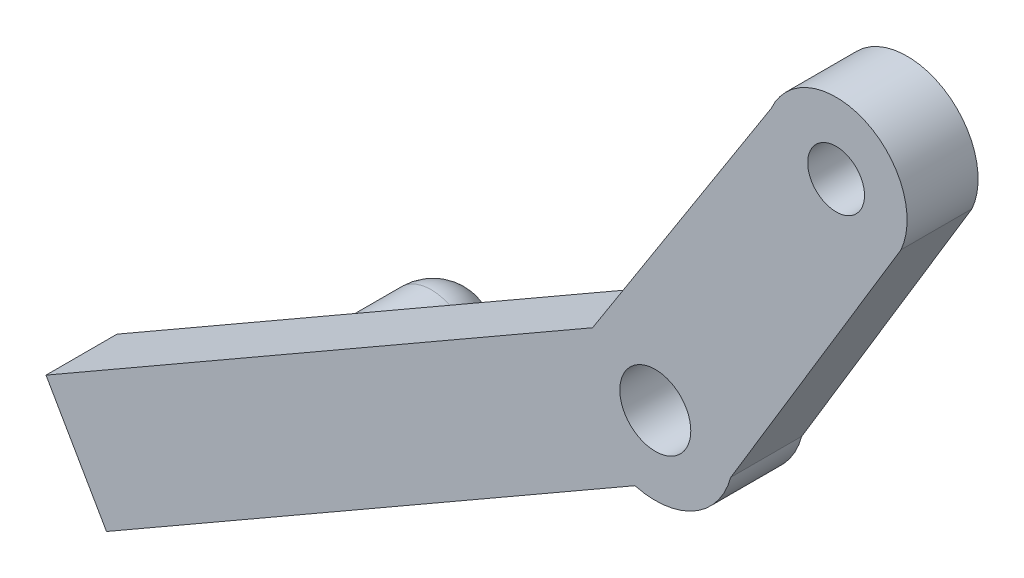
ISO-10303-21;
HEADER;
FILE_DESCRIPTION(('STEP AP214'),'2;1');
FILE_NAME('part.step','',(''),(''),'','','');
FILE_SCHEMA(('AUTOMOTIVE_DESIGN { 1 0 10303 214 1 1 1 1 }'));
ENDSEC;
DATA;
#1=APPLICATION_CONTEXT('core data for automotive mechanical design processes');
#2=APPLICATION_PROTOCOL_DEFINITION('international standard','automotive_design',2000,#1);
#3=PRODUCT_CONTEXT('',#1,'mechanical');
#4=PRODUCT('Part','Part','',(#3));
#5=PRODUCT_RELATED_PRODUCT_CATEGORY('part','',(#4));
#6=PRODUCT_DEFINITION_FORMATION('','',#4);
#7=PRODUCT_DEFINITION_CONTEXT('part definition',#1,'design');
#8=PRODUCT_DEFINITION('design','',#6,#7);
#9=PRODUCT_DEFINITION_SHAPE('','',#8);
#10=(LENGTH_UNIT() NAMED_UNIT(*) SI_UNIT(.MILLI.,.METRE.));
#11=(NAMED_UNIT(*) PLANE_ANGLE_UNIT() SI_UNIT($,.RADIAN.));
#12=(NAMED_UNIT(*) SI_UNIT($,.STERADIAN.) SOLID_ANGLE_UNIT());
#13=UNCERTAINTY_MEASURE_WITH_UNIT(LENGTH_MEASURE(1.E-05),#10,'distance_accuracy_value','');
#14=(GEOMETRIC_REPRESENTATION_CONTEXT(3) GLOBAL_UNCERTAINTY_ASSIGNED_CONTEXT((#13)) GLOBAL_UNIT_ASSIGNED_CONTEXT((#10,
#11,#12)) REPRESENTATION_CONTEXT('',''));
#15=CARTESIAN_POINT('',(0.,0.,0.));
#16=DIRECTION('',(0.,0.,1.));
#17=DIRECTION('',(1.,0.,0.));
#18=AXIS2_PLACEMENT_3D('',#15,#16,#17);
#19=CARTESIAN_POINT('',(-25.2931810081454,-19.8826359089884,-10.));
#20=DIRECTION('',(0.,0.,1.));
#21=DIRECTION('',(1.,0.,0.));
#22=AXIS2_PLACEMENT_3D('',#19,#20,#21);
#23=CYLINDRICAL_SURFACE('',#22,3.00000000000002);
#24=CARTESIAN_POINT('',(-25.2931810081454,-19.8826359089884,0.));
#25=DIRECTION('',(0.,0.,1.));
#26=DIRECTION('',(1.,0.,0.));
#27=AXIS2_PLACEMENT_3D('',#24,#25,#26);
#28=CIRCLE('',#27,3.00000000000002);
#29=CARTESIAN_POINT('',(-22.2931810081454,-19.8826359089884,0.));
#30=VERTEX_POINT('',#29);
#31=EDGE_CURVE('E11',#30,#30,#28,.F.);
#32=ORIENTED_EDGE('',*,*,#31,.T.);
#33=EDGE_LOOP('',(#32));
#34=FACE_BOUND('',#33,.T.);
#35=CARTESIAN_POINT('',(-25.2931810081454,-19.8826359089884,-7.));
#36=DIRECTION('',(0.,0.,-1.));
#37=DIRECTION('',(-1.,0.,0.));
#38=AXIS2_PLACEMENT_3D('',#35,#36,#37);
#39=CIRCLE('',#38,3.00000000000003);
#40=CARTESIAN_POINT('',(-28.2931810081454,-19.8826359089884,-7.));
#41=VERTEX_POINT('',#40);
#42=EDGE_CURVE('E183',#41,#41,#39,.T.);
#43=ORIENTED_EDGE('',*,*,#42,.F.);
#44=EDGE_LOOP('',(#43));
#45=FACE_BOUND('',#44,.T.);
#46=ADVANCED_FACE('F34',(#34,#45),#23,.T.);
#47=CARTESIAN_POINT('',(-0.682703439514869,0.436635830889686,5.));
#48=DIRECTION('',(-0.842436284988127,0.538795977838925,0.));
#49=DIRECTION('',(-0.538795977838925,-0.842436284988127,0.));
#50=AXIS2_PLACEMENT_3D('',#47,#48,#49);
#51=PLANE('',#50);
#52=DIRECTION('',(0.538795977838925,0.842436284988127,0.));
#53=VECTOR('',#52,1.);
#54=CARTESIAN_POINT('',(-0.682703439514869,0.436635830889686,0.));
#55=LINE('',#54,#53);
#56=CARTESIAN_POINT('',(-1.93424021867878,-1.52020875988425,0.));
#57=VERTEX_POINT('',#56);
#58=CARTESIAN_POINT('',(10.6400793801503,18.1404114466345,0.));
#59=VERTEX_POINT('',#58);
#60=EDGE_CURVE('E129',#57,#59,#55,.T.);
#61=ORIENTED_EDGE('',*,*,#60,.F.);
#62=DIRECTION('',(0.,0.,-1.));
#63=VECTOR('',#62,1.);
#64=CARTESIAN_POINT('',(-1.93424021867878,-1.52020875988425,5.));
#65=LINE('',#64,#63);
#66=CARTESIAN_POINT('',(-1.93424021867878,-1.52020875988425,5.));
#67=VERTEX_POINT('',#66);
#68=EDGE_CURVE('E43',#67,#57,#65,.T.);
#69=ORIENTED_EDGE('',*,*,#68,.F.);
#70=DIRECTION('',(0.538795977838925,0.842436284988127,0.));
#71=VECTOR('',#70,1.);
#72=CARTESIAN_POINT('',(-0.682703439514869,0.436635830889686,5.));
#73=LINE('',#72,#71);
#74=CARTESIAN_POINT('',(10.6400793801503,18.1404114466345,5.));
#75=VERTEX_POINT('',#74);
#76=EDGE_CURVE('E150',#67,#75,#73,.T.);
#77=ORIENTED_EDGE('',*,*,#76,.T.);
#78=DIRECTION('',(0.,0.,-1.));
#79=VECTOR('',#78,1.);
#80=CARTESIAN_POINT('',(10.6400793801503,18.1404114466345,5.));
#81=LINE('',#80,#79);
#82=EDGE_CURVE('E84',#75,#59,#81,.T.);
#83=ORIENTED_EDGE('',*,*,#82,.T.);
#84=EDGE_LOOP('',(#61,#69,#77,#83));
#85=FACE_BOUND('',#84,.T.);
#86=ADVANCED_FACE('F36',(#85),#51,.T.);
#87=CARTESIAN_POINT('',(0.17625658415401,-0.30648591573246,5.));
#88=DIRECTION('',(-0.498528903536302,0.866873077410351,0.));
#89=DIRECTION('',(-0.866873077410351,-0.498528903536302,0.));
#90=AXIS2_PLACEMENT_3D('',#87,#88,#89);
#91=PLANE('',#90);
#92=DIRECTION('',(0.866873077410351,0.498528903536302,0.));
#93=VECTOR('',#92,1.);
#94=CARTESIAN_POINT('',(0.17625658415401,-0.30648591573246,0.));
#95=LINE('',#94,#93);
#96=CARTESIAN_POINT('',(-40.4263847840177,-23.6566057999731,0.));
#97=VERTEX_POINT('',#96);
#98=EDGE_CURVE('E132',#97,#57,#95,.T.);
#99=ORIENTED_EDGE('',*,*,#98,.F.);
#100=DIRECTION('',(0.,0.,-1.));
#101=VECTOR('',#100,1.);
#102=CARTESIAN_POINT('',(-40.4263847840177,-23.6566057999731,5.));
#103=LINE('',#102,#101);
#104=CARTESIAN_POINT('',(-40.4263847840177,-23.6566057999731,5.));
#105=VERTEX_POINT('',#104);
#106=EDGE_CURVE('E157',#105,#97,#103,.T.);
#107=ORIENTED_EDGE('',*,*,#106,.F.);
#108=DIRECTION('',(0.866873077410351,0.498528903536302,0.));
#109=VECTOR('',#108,1.);
#110=CARTESIAN_POINT('',(0.17625658415401,-0.30648591573246,5.));
#111=LINE('',#110,#109);
#112=EDGE_CURVE('E163',#105,#67,#111,.T.);
#113=ORIENTED_EDGE('',*,*,#112,.T.);
#114=ORIENTED_EDGE('',*,*,#68,.T.);
#115=EDGE_LOOP('',(#99,#107,#113,#114));
#116=FACE_BOUND('',#115,.T.);
#117=ADVANCED_FACE('F161',(#116),#91,.T.);
#118=CARTESIAN_POINT('',(-40.6026413681717,-23.3501198842406,5.));
#119=DIRECTION('',(0.866873077410351,0.498528903536302,0.));
#120=DIRECTION('',(-0.498528903536302,0.866873077410351,0.));
#121=AXIS2_PLACEMENT_3D('',#118,#119,#120);
#122=PLANE('',#121);
#123=DIRECTION('',(0.498528903536302,-0.866873077410351,0.));
#124=VECTOR('',#123,1.);
#125=CARTESIAN_POINT('',(-40.6026413681717,-23.3501198842406,0.));
#126=LINE('',#125,#124);
#127=CARTESIAN_POINT('',(-36.1661695545836,-31.0645331240926,0.));
#128=VERTEX_POINT('',#127);
#129=EDGE_CURVE('E136',#97,#128,#126,.T.);
#130=ORIENTED_EDGE('',*,*,#129,.T.);
#131=DIRECTION('',(0.,0.,-1.));
#132=VECTOR('',#131,1.);
#133=CARTESIAN_POINT('',(-36.1661695545836,-31.0645331240926,5.));
#134=LINE('',#133,#132);
#135=CARTESIAN_POINT('',(-36.1661695545836,-31.0645331240926,5.));
#136=VERTEX_POINT('',#135);
#137=EDGE_CURVE('E154',#136,#128,#134,.T.);
#138=ORIENTED_EDGE('',*,*,#137,.F.);
#139=DIRECTION('',(0.498528903536302,-0.866873077410351,0.));
#140=VECTOR('',#139,1.);
#141=CARTESIAN_POINT('',(-40.6026413681717,-23.3501198842406,5.));
#142=LINE('',#141,#140);
#143=EDGE_CURVE('E176',#105,#136,#142,.T.);
#144=ORIENTED_EDGE('',*,*,#143,.F.);
#145=ORIENTED_EDGE('',*,*,#106,.T.);
#146=EDGE_LOOP('',(#130,#138,#144,#145));
#147=FACE_BOUND('',#146,.T.);
#148=ADVANCED_FACE('F172',(#147),#122,.F.);
#149=CARTESIAN_POINT('',(4.43647181358803,-7.71441323985198,5.));
#150=DIRECTION('',(-0.498528903536302,0.866873077410351,0.));
#151=DIRECTION('',(-0.866873077410351,-0.498528903536302,0.));
#152=AXIS2_PLACEMENT_3D('',#149,#150,#151);
#153=PLANE('',#152);
#154=DIRECTION('',(0.866873077410351,0.498528903536302,0.));
#155=VECTOR('',#154,1.);
#156=CARTESIAN_POINT('',(4.43647181358803,-7.71441323985198,0.));
#157=LINE('',#156,#155);
#158=CARTESIAN_POINT('',(1.04782478556533,-9.66318582418271,0.));
#159=VERTEX_POINT('',#158);
#160=EDGE_CURVE('E138',#128,#159,#157,.T.);
#161=ORIENTED_EDGE('',*,*,#160,.T.);
#162=DIRECTION('',(0.,0.,-1.));
#163=VECTOR('',#162,1.);
#164=CARTESIAN_POINT('',(1.04782478556533,-9.66318582418271,5.));
#165=LINE('',#164,#163);
#166=CARTESIAN_POINT('',(1.04782478556533,-9.66318582418271,5.));
#167=VERTEX_POINT('',#166);
#168=EDGE_CURVE('E115',#167,#159,#165,.T.);
#169=ORIENTED_EDGE('',*,*,#168,.F.);
#170=DIRECTION('',(0.866873077410351,0.498528903536302,0.));
#171=VECTOR('',#170,1.);
#172=CARTESIAN_POINT('',(4.43647181358803,-7.71441323985198,5.));
#173=LINE('',#172,#171);
#174=EDGE_CURVE('E106',#136,#167,#173,.T.);
#175=ORIENTED_EDGE('',*,*,#174,.F.);
#176=ORIENTED_EDGE('',*,*,#137,.T.);
#177=EDGE_LOOP('',(#161,#169,#175,#176));
#178=FACE_BOUND('',#177,.T.);
#179=ADVANCED_FACE('F175',(#178),#153,.F.);
#180=CARTESIAN_POINT('',(2.48034743292827,-4.35301832543163,5.));
#181=DIRECTION('',(0.,0.,-1.));
#182=DIRECTION('',(-1.,0.,0.));
#183=AXIS2_PLACEMENT_3D('',#180,#181,#182);
#184=CYLINDRICAL_SURFACE('',#183,5.5);
#185=CARTESIAN_POINT('',(2.48034743292827,-4.35301832543163,0.));
#186=DIRECTION('',(0.,0.,1.));
#187=DIRECTION('',(1.,0.,0.));
#188=AXIS2_PLACEMENT_3D('',#185,#186,#187);
#189=CIRCLE('',#188,5.5);
#190=CARTESIAN_POINT('',(7.79051493167935,-5.78554097279456,0.));
#191=VERTEX_POINT('',#190);
#192=EDGE_CURVE('E114',#159,#191,#189,.T.);
#193=ORIENTED_EDGE('',*,*,#192,.T.);
#194=DIRECTION('',(0.,0.,-1.));
#195=VECTOR('',#194,1.);
#196=CARTESIAN_POINT('',(7.79051493167935,-5.78554097279456,5.));
#197=LINE('',#196,#195);
#198=CARTESIAN_POINT('',(7.79051493167935,-5.78554097279456,5.));
#199=VERTEX_POINT('',#198);
#200=EDGE_CURVE('E111',#199,#191,#197,.T.);
#201=ORIENTED_EDGE('',*,*,#200,.F.);
#202=CARTESIAN_POINT('',(2.48034743292827,-4.35301832543163,5.));
#203=DIRECTION('',(0.,0.,1.));
#204=DIRECTION('',(1.,0.,0.));
#205=AXIS2_PLACEMENT_3D('',#202,#203,#204);
#206=CIRCLE('',#205,5.5);
#207=EDGE_CURVE('E99',#167,#199,#206,.T.);
#208=ORIENTED_EDGE('',*,*,#207,.F.);
#209=ORIENTED_EDGE('',*,*,#168,.T.);
#210=EDGE_LOOP('',(#193,#201,#208,#209));
#211=FACE_BOUND('',#210,.T.);
#212=ADVANCED_FACE('F112',(#211),#184,.T.);
#213=CARTESIAN_POINT('',(8.27057905312399,-4.98984292672802,5.));
#214=DIRECTION('',(-0.856234541670631,0.51658727205583,0.));
#215=DIRECTION('',(-0.51658727205583,-0.856234541670632,0.));
#216=AXIS2_PLACEMENT_3D('',#213,#214,#215);
#217=PLANE('',#216);
#218=DIRECTION('',(0.51658727205583,0.856234541670631,0.));
#219=VECTOR('',#218,1.);
#220=CARTESIAN_POINT('',(8.27057905312399,-4.98984292672802,0.));
#221=LINE('',#220,#219);
#222=CARTESIAN_POINT('',(19.7862245967424,14.097142017446,0.));
#223=VERTEX_POINT('',#222);
#224=EDGE_CURVE('E77',#191,#223,#221,.T.);
#225=ORIENTED_EDGE('',*,*,#224,.T.);
#226=DIRECTION('',(0.,0.,-1.));
#227=VECTOR('',#226,1.);
#228=CARTESIAN_POINT('',(19.7862245967424,14.097142017446,5.));
#229=LINE('',#228,#227);
#230=CARTESIAN_POINT('',(19.7862245967424,14.097142017446,5.));
#231=VERTEX_POINT('',#230);
#232=EDGE_CURVE('E116',#231,#223,#229,.T.);
#233=ORIENTED_EDGE('',*,*,#232,.F.);
#234=DIRECTION('',(0.51658727205583,0.856234541670631,0.));
#235=VECTOR('',#234,1.);
#236=CARTESIAN_POINT('',(8.27057905312399,-4.98984292672802,5.));
#237=LINE('',#236,#235);
#238=EDGE_CURVE('E104',#199,#231,#237,.T.);
#239=ORIENTED_EDGE('',*,*,#238,.F.);
#240=ORIENTED_EDGE('',*,*,#200,.T.);
#241=EDGE_LOOP('',(#225,#233,#239,#240));
#242=FACE_BOUND('',#241,.T.);
#243=ADVANCED_FACE('F118',(#242),#217,.F.);
#244=CARTESIAN_POINT('',(15.2131519884464,16.1187767320402,5.));
#245=DIRECTION('',(0.,0.,-1.));
#246=DIRECTION('',(-1.,0.,0.));
#247=AXIS2_PLACEMENT_3D('',#244,#245,#246);
#248=CYLINDRICAL_SURFACE('',#247,2.);
#249=CARTESIAN_POINT('',(15.2131519884464,16.1187767320402,5.));
#250=DIRECTION('',(0.,0.,1.));
#251=DIRECTION('',(1.,0.,0.));
#252=AXIS2_PLACEMENT_3D('',#249,#250,#251);
#253=CIRCLE('',#252,2.);
#254=CARTESIAN_POINT('',(17.2131519884464,16.1187767320402,5.));
#255=VERTEX_POINT('',#254);
#256=EDGE_CURVE('E120',#255,#255,#253,.T.);
#257=ORIENTED_EDGE('',*,*,#256,.T.);
#258=EDGE_LOOP('',(#257));
#259=FACE_BOUND('',#258,.T.);
#260=CARTESIAN_POINT('',(15.2131519884464,16.1187767320402,0.));
#261=DIRECTION('',(0.,0.,1.));
#262=DIRECTION('',(1.,0.,0.));
#263=AXIS2_PLACEMENT_3D('',#260,#261,#262);
#264=CIRCLE('',#263,2.);
#265=CARTESIAN_POINT('',(17.2131519884464,16.1187767320402,0.));
#266=VERTEX_POINT('',#265);
#267=EDGE_CURVE('E144',#266,#266,#264,.T.);
#268=ORIENTED_EDGE('',*,*,#267,.F.);
#269=EDGE_LOOP('',(#268));
#270=FACE_BOUND('',#269,.T.);
#271=ADVANCED_FACE('F210',(#259,#270),#248,.F.);
#272=CARTESIAN_POINT('',(15.2131519884464,16.1187767320402,5.));
#273=DIRECTION('',(0.,0.,-1.));
#274=DIRECTION('',(-1.,0.,0.));
#275=AXIS2_PLACEMENT_3D('',#272,#273,#274);
#276=CYLINDRICAL_SURFACE('',#275,5.);
#277=CARTESIAN_POINT('',(15.2131519884464,16.1187767320402,0.));
#278=DIRECTION('',(0.,0.,1.));
#279=DIRECTION('',(1.,0.,0.));
#280=AXIS2_PLACEMENT_3D('',#277,#278,#279);
#281=CIRCLE('',#280,5.);
#282=EDGE_CURVE('E142',#223,#59,#281,.T.);
#283=ORIENTED_EDGE('',*,*,#282,.T.);
#284=ORIENTED_EDGE('',*,*,#82,.F.);
#285=CARTESIAN_POINT('',(15.2131519884464,16.1187767320402,5.));
#286=DIRECTION('',(0.,0.,1.));
#287=DIRECTION('',(1.,0.,0.));
#288=AXIS2_PLACEMENT_3D('',#285,#286,#287);
#289=CIRCLE('',#288,5.);
#290=EDGE_CURVE('E51',#231,#75,#289,.T.);
#291=ORIENTED_EDGE('',*,*,#290,.F.);
#292=ORIENTED_EDGE('',*,*,#232,.T.);
#293=EDGE_LOOP('',(#283,#284,#291,#292));
#294=FACE_BOUND('',#293,.T.);
#295=ADVANCED_FACE('F208',(#294),#276,.T.);
#296=CARTESIAN_POINT('',(2.48034743292827,-4.35301832543163,5.));
#297=DIRECTION('',(0.,0.,-1.));
#298=DIRECTION('',(-1.,0.,0.));
#299=AXIS2_PLACEMENT_3D('',#296,#297,#298);
#300=CYLINDRICAL_SURFACE('',#299,2.5);
#301=CARTESIAN_POINT('',(2.48034743292827,-4.35301832543163,5.));
#302=DIRECTION('',(0.,0.,1.));
#303=DIRECTION('',(1.,0.,0.));
#304=AXIS2_PLACEMENT_3D('',#301,#302,#303);
#305=CIRCLE('',#304,2.5);
#306=CARTESIAN_POINT('',(4.98034743292827,-4.35301832543163,5.));
#307=VERTEX_POINT('',#306);
#308=EDGE_CURVE('E126',#307,#307,#305,.T.);
#309=ORIENTED_EDGE('',*,*,#308,.T.);
#310=EDGE_LOOP('',(#309));
#311=FACE_BOUND('',#310,.T.);
#312=CARTESIAN_POINT('',(2.48034743292827,-4.35301832543163,0.));
#313=DIRECTION('',(0.,0.,1.));
#314=DIRECTION('',(1.,0.,0.));
#315=AXIS2_PLACEMENT_3D('',#312,#313,#314);
#316=CIRCLE('',#315,2.5);
#317=CARTESIAN_POINT('',(4.98034743292827,-4.35301832543163,0.));
#318=VERTEX_POINT('',#317);
#319=EDGE_CURVE('E147',#318,#318,#316,.T.);
#320=ORIENTED_EDGE('',*,*,#319,.F.);
#321=EDGE_LOOP('',(#320));
#322=FACE_BOUND('',#321,.T.);
#323=ADVANCED_FACE('F202',(#311,#322),#300,.F.);
#324=CARTESIAN_POINT('',(0.,0.,5.));
#325=DIRECTION('',(0.,0.,1.));
#326=DIRECTION('',(1.,0.,0.));
#327=AXIS2_PLACEMENT_3D('',#324,#325,#326);
#328=PLANE('',#327);
#329=ORIENTED_EDGE('',*,*,#76,.F.);
#330=ORIENTED_EDGE('',*,*,#112,.F.);
#331=ORIENTED_EDGE('',*,*,#143,.T.);
#332=ORIENTED_EDGE('',*,*,#174,.T.);
#333=ORIENTED_EDGE('',*,*,#207,.T.);
#334=ORIENTED_EDGE('',*,*,#238,.T.);
#335=ORIENTED_EDGE('',*,*,#290,.T.);
#336=EDGE_LOOP('',(#329,#330,#331,#332,#333,#334,#335));
#337=FACE_BOUND('',#336,.T.);
#338=ORIENTED_EDGE('',*,*,#256,.F.);
#339=EDGE_LOOP('',(#338));
#340=FACE_BOUND('',#339,.T.);
#341=ORIENTED_EDGE('',*,*,#308,.F.);
#342=EDGE_LOOP('',(#341));
#343=FACE_BOUND('',#342,.T.);
#344=ADVANCED_FACE('F101',(#337,#340,#343),#328,.T.);
#345=CARTESIAN_POINT('',(0.,0.,0.));
#346=DIRECTION('',(0.,0.,1.));
#347=DIRECTION('',(1.,0.,0.));
#348=AXIS2_PLACEMENT_3D('',#345,#346,#347);
#349=PLANE('',#348);
#350=ORIENTED_EDGE('',*,*,#31,.F.);
#351=EDGE_LOOP('',(#350));
#352=FACE_BOUND('',#351,.T.);
#353=ORIENTED_EDGE('',*,*,#60,.T.);
#354=ORIENTED_EDGE('',*,*,#282,.F.);
#355=ORIENTED_EDGE('',*,*,#224,.F.);
#356=ORIENTED_EDGE('',*,*,#192,.F.);
#357=ORIENTED_EDGE('',*,*,#160,.F.);
#358=ORIENTED_EDGE('',*,*,#129,.F.);
#359=ORIENTED_EDGE('',*,*,#98,.T.);
#360=EDGE_LOOP('',(#353,#354,#355,#356,#357,#358,#359));
#361=FACE_BOUND('',#360,.T.);
#362=ORIENTED_EDGE('',*,*,#267,.T.);
#363=EDGE_LOOP('',(#362));
#364=FACE_BOUND('',#363,.T.);
#365=ORIENTED_EDGE('',*,*,#319,.T.);
#366=EDGE_LOOP('',(#365));
#367=FACE_BOUND('',#366,.T.);
#368=ADVANCED_FACE('F167',(#352,#361,#364,#367),#349,.F.);
#369=CARTESIAN_POINT('',(-25.2931810081454,-19.8826359089884,-7.));
#370=DIRECTION('',(0.,0.,-1.));
#371=DIRECTION('',(-1.,0.,0.));
#372=AXIS2_PLACEMENT_3D('',#369,#370,#371);
#373=DEGENERATE_TOROIDAL_SURFACE('',#372,0.249999999999958,3.24999999999998,.F.);
#374=ORIENTED_EDGE('',*,*,#42,.T.);
#375=EDGE_LOOP('',(#374));
#376=FACE_BOUND('',#375,.T.);
#377=CARTESIAN_POINT('',(-25.2931810081454,-19.8826359089884,-10.));
#378=DIRECTION('',(0.,0.,-1.));
#379=DIRECTION('',(-1.,0.,0.));
#380=AXIS2_PLACEMENT_3D('',#377,#378,#379);
#381=CIRCLE('',#380,1.);
#382=CARTESIAN_POINT('',(-26.2931810081454,-19.8826359089884,-10.));
#383=VERTEX_POINT('',#382);
#384=EDGE_CURVE('E133',#383,#383,#381,.T.);
#385=ORIENTED_EDGE('',*,*,#384,.F.);
#386=EDGE_LOOP('',(#385));
#387=FACE_BOUND('',#386,.T.);
#388=ADVANCED_FACE('F187',(#376,#387),#373,.F.);
#389=CARTESIAN_POINT('',(-25.2931810081454,-19.8826359089884,-10.));
#390=DIRECTION('',(0.,0.,-1.));
#391=DIRECTION('',(-1.,0.,0.));
#392=AXIS2_PLACEMENT_3D('',#389,#390,#391);
#393=PLANE('',#392);
#394=ORIENTED_EDGE('',*,*,#384,.T.);
#395=EDGE_LOOP('',(#394));
#396=FACE_BOUND('',#395,.T.);
#397=ADVANCED_FACE('F198',(#396),#393,.T.);
#398=CLOSED_SHELL('',(#46,#86,#117,#148,#179,#212,#243,#271,#295,#323,#344,#368,#388,#397));
#399=MANIFOLD_SOLID_BREP('B2',#398);
#400=ADVANCED_BREP_SHAPE_REPRESENTATION('',(#18,#399),#14);
#401=SHAPE_DEFINITION_REPRESENTATION(#9,#400);
ENDSEC;
END-ISO-10303-21;
